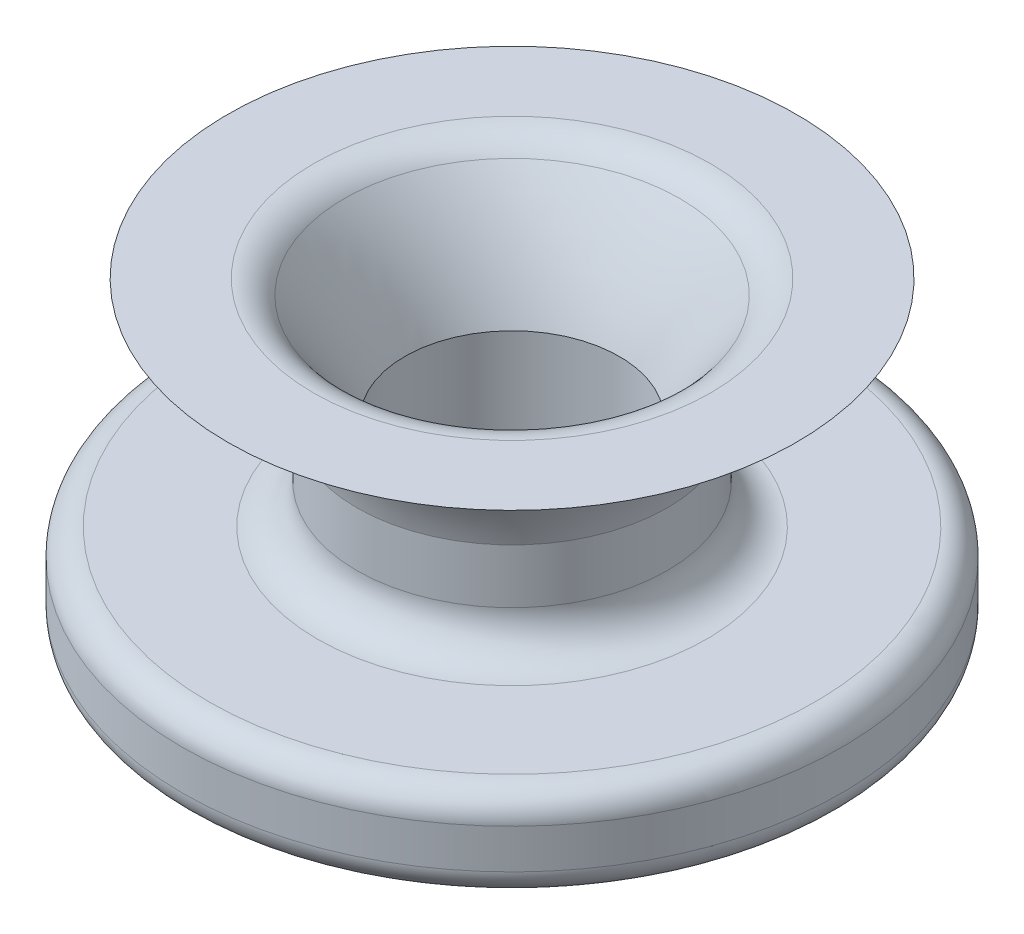
ISO-10303-21;
HEADER;
FILE_DESCRIPTION(('STEP AP214'),'2;1');
FILE_NAME('part.step','',(''),(''),'','','');
FILE_SCHEMA(('AUTOMOTIVE_DESIGN { 1 0 10303 214 1 1 1 1 }'));
ENDSEC;
DATA;
#1=APPLICATION_CONTEXT('core data for automotive mechanical design processes');
#2=APPLICATION_PROTOCOL_DEFINITION('international standard','automotive_design',2000,#1);
#3=PRODUCT_CONTEXT('',#1,'mechanical');
#4=PRODUCT('Part','Part','',(#3));
#5=PRODUCT_RELATED_PRODUCT_CATEGORY('part','',(#4));
#6=PRODUCT_DEFINITION_FORMATION('','',#4);
#7=PRODUCT_DEFINITION_CONTEXT('part definition',#1,'design');
#8=PRODUCT_DEFINITION('design','',#6,#7);
#9=PRODUCT_DEFINITION_SHAPE('','',#8);
#10=(LENGTH_UNIT() NAMED_UNIT(*) SI_UNIT(.MILLI.,.METRE.));
#11=(NAMED_UNIT(*) PLANE_ANGLE_UNIT() SI_UNIT($,.RADIAN.));
#12=(NAMED_UNIT(*) SI_UNIT($,.STERADIAN.) SOLID_ANGLE_UNIT());
#13=UNCERTAINTY_MEASURE_WITH_UNIT(LENGTH_MEASURE(1.E-05),#10,'distance_accuracy_value','');
#14=(GEOMETRIC_REPRESENTATION_CONTEXT(3) GLOBAL_UNCERTAINTY_ASSIGNED_CONTEXT((#13)) GLOBAL_UNIT_ASSIGNED_CONTEXT((#10,
#11,#12)) REPRESENTATION_CONTEXT('',''));
#15=CARTESIAN_POINT('',(0.,0.,0.));
#16=DIRECTION('',(0.,0.,1.));
#17=DIRECTION('',(1.,0.,0.));
#18=AXIS2_PLACEMENT_3D('',#15,#16,#17);
#19=CARTESIAN_POINT('',(0.,17.78,0.));
#20=DIRECTION('',(0.,-1.,0.));
#21=DIRECTION('',(0.,0.,-1.));
#22=AXIS2_PLACEMENT_3D('',#19,#20,#21);
#23=CYLINDRICAL_SURFACE('',#22,63.5);
#24=CARTESIAN_POINT('',(0.,12.7,0.));
#25=DIRECTION('',(0.,1.,0.));
#26=DIRECTION('',(0.,0.,1.));
#27=AXIS2_PLACEMENT_3D('',#24,#25,#26);
#28=CIRCLE('',#27,63.5);
#29=CARTESIAN_POINT('',(0.,12.7,63.5));
#30=VERTEX_POINT('',#29);
#31=EDGE_CURVE('E76',#30,#30,#28,.F.);
#32=ORIENTED_EDGE('',*,*,#31,.T.);
#33=EDGE_LOOP('',(#32));
#34=FACE_BOUND('',#33,.T.);
#35=CARTESIAN_POINT('',(0.,5.08,0.));
#36=DIRECTION('',(0.,1.,0.));
#37=DIRECTION('',(0.,0.,1.));
#38=AXIS2_PLACEMENT_3D('',#35,#36,#37);
#39=CIRCLE('',#38,63.5);
#40=CARTESIAN_POINT('',(0.,5.08,63.5));
#41=VERTEX_POINT('',#40);
#42=EDGE_CURVE('E104',#41,#41,#39,.T.);
#43=ORIENTED_EDGE('',*,*,#42,.T.);
#44=EDGE_LOOP('',(#43));
#45=FACE_BOUND('',#44,.T.);
#46=ADVANCED_FACE('F52',(#34,#45),#23,.T.);
#47=CARTESIAN_POINT('',(0.,17.78,0.));
#48=DIRECTION('',(0.,1.,0.));
#49=DIRECTION('',(0.,0.,1.));
#50=AXIS2_PLACEMENT_3D('',#47,#48,#49);
#51=PLANE('',#50);
#52=CARTESIAN_POINT('',(0.,17.78,0.));
#53=DIRECTION('',(0.,1.,0.));
#54=DIRECTION('',(0.,0.,1.));
#55=AXIS2_PLACEMENT_3D('',#52,#53,#54);
#56=CIRCLE('',#55,37.5120185921209);
#57=CARTESIAN_POINT('',(0.,17.78,37.5120185921209));
#58=VERTEX_POINT('',#57);
#59=EDGE_CURVE('E65',#58,#58,#56,.F.);
#60=ORIENTED_EDGE('',*,*,#59,.T.);
#61=EDGE_LOOP('',(#60));
#62=FACE_BOUND('',#61,.T.);
#63=CARTESIAN_POINT('',(0.,17.78,0.));
#64=DIRECTION('',(0.,1.,0.));
#65=DIRECTION('',(0.,0.,1.));
#66=AXIS2_PLACEMENT_3D('',#63,#64,#65);
#67=CIRCLE('',#66,58.42);
#68=CARTESIAN_POINT('',(0.,17.78,58.42));
#69=VERTEX_POINT('',#68);
#70=EDGE_CURVE('E80',#69,#69,#67,.T.);
#71=ORIENTED_EDGE('',*,*,#70,.T.);
#72=EDGE_LOOP('',(#71));
#73=FACE_BOUND('',#72,.T.);
#74=ADVANCED_FACE('F163',(#62,#73),#51,.T.);
#75=CARTESIAN_POINT('',(0.,0.,0.));
#76=DIRECTION('',(0.,1.,0.));
#77=DIRECTION('',(0.,0.,1.));
#78=AXIS2_PLACEMENT_3D('',#75,#76,#77);
#79=PLANE('',#78);
#80=CARTESIAN_POINT('',(0.,0.,0.));
#81=DIRECTION('',(0.,1.,0.));
#82=DIRECTION('',(0.,0.,1.));
#83=AXIS2_PLACEMENT_3D('',#80,#81,#82);
#84=CIRCLE('',#83,58.42);
#85=CARTESIAN_POINT('',(0.,0.,58.42));
#86=VERTEX_POINT('',#85);
#87=EDGE_CURVE('E96',#86,#86,#84,.F.);
#88=ORIENTED_EDGE('',*,*,#87,.T.);
#89=EDGE_LOOP('',(#88));
#90=FACE_BOUND('',#89,.T.);
#91=CARTESIAN_POINT('',(0.,0.,0.));
#92=DIRECTION('',(0.,1.,0.));
#93=DIRECTION('',(0.,0.,1.));
#94=AXIS2_PLACEMENT_3D('',#91,#92,#93);
#95=CIRCLE('',#94,30.4465710395546);
#96=CARTESIAN_POINT('',(0.,0.,30.4465710395546));
#97=VERTEX_POINT('',#96);
#98=EDGE_CURVE('E100',#97,#97,#95,.T.);
#99=ORIENTED_EDGE('',*,*,#98,.T.);
#100=EDGE_LOOP('',(#99));
#101=FACE_BOUND('',#100,.T.);
#102=ADVANCED_FACE('F161',(#90,#101),#79,.F.);
#103=CARTESIAN_POINT('',(0.,-20.32,0.));
#104=DIRECTION('',(0.,1.,0.));
#105=DIRECTION('',(0.,0.,1.));
#106=AXIS2_PLACEMENT_3D('',#103,#104,#105);
#107=CYLINDRICAL_SURFACE('',#106,25.3665710395546);
#108=CARTESIAN_POINT('',(0.,-5.08,0.));
#109=DIRECTION('',(0.,1.,0.));
#110=DIRECTION('',(0.,0.,1.));
#111=AXIS2_PLACEMENT_3D('',#108,#109,#110);
#112=CIRCLE('',#111,25.3665710395546);
#113=CARTESIAN_POINT('',(0.,-5.08,25.3665710395546));
#114=VERTEX_POINT('',#113);
#115=EDGE_CURVE('E92',#114,#114,#112,.F.);
#116=ORIENTED_EDGE('',*,*,#115,.T.);
#117=EDGE_LOOP('',(#116));
#118=FACE_BOUND('',#117,.T.);
#119=CARTESIAN_POINT('',(0.,-14.0589377589314,25.3665710395546));
#120=CARTESIAN_POINT('',(-0.212725574957583,-14.0589289889175,25.3665676270994));
#121=CARTESIAN_POINT('',(-0.425574499846383,-14.0410617989644,25.3638671042424));
#122=CARTESIAN_POINT('',(-0.84532267746515,-13.9700833462718,25.3533540914481));
#123=CARTESIAN_POINT('',(-1.05221593615985,-13.9169377886341,25.3455366273198));
#124=CARTESIAN_POINT('',(-1.45391746551735,-13.7770266266348,25.3256682192015));
#125=CARTESIAN_POINT('',(-1.64873474963173,-13.690286456371,25.3136204785486));
#126=CARTESIAN_POINT('',(-2.02101919870925,-13.4857105006767,25.2866227141975));
#127=CARTESIAN_POINT('',(-2.19848876385938,-13.3678790253306,25.2716730928532));
#128=CARTESIAN_POINT('',(-2.53245968787075,-13.1034819839262,25.2404030273083));
#129=CARTESIAN_POINT('',(-2.68880550104564,-12.9567209695592,25.2240737163019));
#130=CARTESIAN_POINT('',(-2.97474880628645,-12.6390514292007,25.1919540712024));
#131=CARTESIAN_POINT('',(-3.10434475815415,-12.4681415137224,25.1761637681879));
#132=CARTESIAN_POINT('',(-3.33371526341743,-12.1059803443042,25.1468239133494));
#133=CARTESIAN_POINT('',(-3.43333928774484,-11.914632745732,25.1332858199334));
#134=CARTESIAN_POINT('',(-3.59897599603816,-11.5176833917692,25.1101042630116));
#135=CARTESIAN_POINT('',(-3.66499051678523,-11.3120824160328,25.1004605866793));
#136=CARTESIAN_POINT('',(-3.76105117321898,-10.8940985295974,25.0862469144643));
#137=CARTESIAN_POINT('',(-3.79136362297402,-10.6817781230826,25.0816393711629));
#138=CARTESIAN_POINT('',(-3.81598470123001,-10.2550182017739,25.0779056507718));
#139=CARTESIAN_POINT('',(-3.81029540234333,-10.0405788096792,25.0787791581392));
#140=CARTESIAN_POINT('',(-3.76329211122909,-9.61754957649355,25.0858745110686));
#141=CARTESIAN_POINT('',(-3.72227475813492,-9.40892592086827,25.0920518208331));
#142=CARTESIAN_POINT('',(-3.60624406271129,-9.00155603258722,25.1089891761807));
#143=CARTESIAN_POINT('',(-3.53122975634796,-8.80281008020566,25.1197493517172));
#144=CARTESIAN_POINT('',(-3.34902609739461,-8.41993489041128,25.1446892147121));
#145=CARTESIAN_POINT('',(-3.24171112424128,-8.23586633598504,25.1588822096339));
#146=CARTESIAN_POINT('',(-2.99804187160865,-7.88823706257353,25.1890788989909));
#147=CARTESIAN_POINT('',(-2.86168568126504,-7.72467769418461,25.2050827125426));
#148=CARTESIAN_POINT('',(-2.56217648810561,-7.42099046371648,25.2372945666815));
#149=CARTESIAN_POINT('',(-2.39876845161162,-7.28111405077884,25.2535030457687));
#150=CARTESIAN_POINT('',(-2.05066326938029,-7.03073225924491,25.2841488842157));
#151=CARTESIAN_POINT('',(-1.8659660299775,-6.92022700987909,25.2985862357825));
#152=CARTESIAN_POINT('',(-1.48030715155694,-6.7317113328485,25.3240782631661));
#153=CARTESIAN_POINT('',(-1.27933587126795,-6.65372033838984,25.3351309149622));
#154=CARTESIAN_POINT('',(-0.866945434234308,-6.53266582650016,25.352591284686));
#155=CARTESIAN_POINT('',(-0.655526986726603,-6.48959994152109,25.358999317466));
#156=CARTESIAN_POINT('',(-0.230413765214077,-6.43995256593997,25.3664067282033));
#157=CARTESIAN_POINT('',(-0.0167602226955133,-6.43302538862371,25.3674573505551));
#158=CARTESIAN_POINT('',(0.408657508707453,-6.45493445839469,25.3641710654188));
#159=CARTESIAN_POINT('',(0.620421756034826,-6.48376959532928,25.3598343251681));
#160=CARTESIAN_POINT('',(1.03500236250965,-6.57609731800804,25.3462922960482));
#161=CARTESIAN_POINT('',(1.23785707451067,-6.6394214569481,25.3371106766594));
#162=CARTESIAN_POINT('',(1.63007015862704,-6.7987519860428,25.3149050642436));
#163=CARTESIAN_POINT('',(1.81942789497277,-6.89475991452545,25.3018808903629));
#164=CARTESIAN_POINT('',(2.18079170080593,-7.11754349514817,25.2733101698299));
#165=CARTESIAN_POINT('',(2.35266117996513,-7.24453839055214,25.2577459233612));
#166=CARTESIAN_POINT('',(2.67277147596659,-7.52538578138643,25.2258824314327));
#167=CARTESIAN_POINT('',(2.82101091478097,-7.6792398420614,25.2095831431787));
#168=CARTESIAN_POINT('',(3.09091124959624,-8.01097726512099,25.1779240749576));
#169=CARTESIAN_POINT('',(3.21234039793021,-8.18905016181314,25.1625732546789));
#170=CARTESIAN_POINT('',(3.42356227952585,-8.56326856759309,25.1347079931214));
#171=CARTESIAN_POINT('',(3.51335586932431,-8.75941358719442,25.1221934750528));
#172=CARTESIAN_POINT('',(3.65839869536605,-9.16351784001947,25.1014826297831));
#173=CARTESIAN_POINT('',(3.71376981193218,-9.37143251302482,25.0932710833834));
#174=CARTESIAN_POINT('',(3.78878375569364,-9.79374275126588,25.082055475485));
#175=CARTESIAN_POINT('',(3.808429057303,-10.0081378666124,25.0790510533351));
#176=CARTESIAN_POINT('',(3.81137473425493,-10.4350131345762,25.0786033525456));
#177=CARTESIAN_POINT('',(3.79503950308554,-10.6474908039106,25.0811043178415));
#178=CARTESIAN_POINT('',(3.72726876839914,-11.0666405541305,25.0912644081167));
#179=CARTESIAN_POINT('',(3.67583332173517,-11.2733126444188,25.0989235247412));
#180=CARTESIAN_POINT('',(3.53945119301433,-11.674883136285,25.1185174161217));
#181=CARTESIAN_POINT('',(3.45453004689416,-11.8697903793503,25.1304489321432));
#182=CARTESIAN_POINT('',(3.25362340634711,-12.2426497385904,25.1572472024579));
#183=CARTESIAN_POINT('',(3.13763685447357,-12.4206012773242,25.1721140566636));
#184=CARTESIAN_POINT('',(2.87656825288623,-12.7563490529292,25.2032871110597));
#185=CARTESIAN_POINT('',(2.73121634776089,-12.9139343210125,25.2196058115575));
#186=CARTESIAN_POINT('',(2.41611329134012,-13.2026063040384,25.2517395517417));
#187=CARTESIAN_POINT('',(2.24635647708284,-13.3336868517392,25.267554473487));
#188=CARTESIAN_POINT('',(1.88616004677103,-13.5662749442242,25.2969984572387));
#189=CARTESIAN_POINT('',(1.69561144818651,-13.6676152750084,25.3106149731665));
#190=CARTESIAN_POINT('',(1.30008284483206,-13.8367012689529,25.3340048917714));
#191=CARTESIAN_POINT('',(1.09511803240672,-13.90448171049,25.3437822707917));
#192=CARTESIAN_POINT('',(0.741029616655482,-13.9891550138838,25.356161605614));
#193=CARTESIAN_POINT('',(0.594091102171736,-14.0152835268601,25.3600450855099));
#194=CARTESIAN_POINT('',(0.298121904508435,-14.0501778643661,25.3652509823352));
#195=CARTESIAN_POINT('',(0.149091247452599,-14.0589439054999,25.3665734312144));
#196=CARTESIAN_POINT('',(0.,-14.0589377589314,25.3665710395546));
#197=B_SPLINE_CURVE_WITH_KNOTS('',3,(#119,#120,#121,#122,#123,#124,#125,#126,#127,#128,#129,
#130,#131,#132,#133,#134,#135,#136,#137,#138,#139,#140,#141,#142,#143,#144,#145,#146,#147,#148,
#149,#150,#151,#152,#153,#154,#155,#156,#157,#158,#159,#160,#161,#162,#163,#164,#165,#166,#167,
#168,#169,#170,#171,#172,#173,#174,#175,#176,#177,#178,#179,#180,#181,#182,#183,#184,#185,#186,
#187,#188,#189,#190,#191,#192,#193,#194,#195,#196),.UNSPECIFIED.,.T.,.F.,(4,2,2,2,2,2,2,2,2,2,2,
2,2,2,2,2,2,2,2,2,2,2,2,2,2,2,2,2,2,2,2,2,2,2,2,2,2,2,4),(0.,0.637631926955998,1.27588461985455,
1.91365504053457,2.55133709562519,3.19348488909086,3.83566964570774,4.48102780163782,
5.12635068453955,5.76682876596024,6.40726997554061,7.04238544213786,7.67751891950017,
8.31515513191086,8.95283331270443,9.59690685453292,10.24098323018,10.885444009122,
11.5298610968786,12.1681025247761,12.8063241405421,13.4414562289561,14.0766182152681,
14.7164115881896,15.3562422581617,16.0014040883906,16.646548449438,17.2893953272137,
17.9321976789255,18.5685199978716,19.2048412861468,19.8406782562659,20.4765368726226,
21.1185287975874,21.7606699327538,22.4063552097743,23.0513699502122,23.4982674397446,
23.9451593540076),.UNSPECIFIED.);
#198=CARTESIAN_POINT('',(0.,-14.0589377589314,25.3665710395546));
#199=VERTEX_POINT('',#198);
#200=EDGE_CURVE('E149',#199,#199,#197,.T.);
#201=ORIENTED_EDGE('',*,*,#200,.T.);
#202=EDGE_LOOP('',(#201));
#203=FACE_BOUND('',#202,.T.);
#204=CARTESIAN_POINT('',(-3.81,-10.2489377589314,-25.0788122985274));
#205=CARTESIAN_POINT('',(-3.80999121693559,-10.4616480770084,-25.0788158577498));
#206=CARTESIAN_POINT('',(-3.79212650329176,-10.6744817859889,-25.0815477907949));
#207=CARTESIAN_POINT('',(-3.72115877925998,-11.0941983559161,-25.0921729142172));
#208=CARTESIAN_POINT('',(-3.6680214188822,-11.3010752107188,-25.1000711356343));
#209=CARTESIAN_POINT('',(-3.52813422999532,-11.7027420312132,-25.1201145384984));
#210=CARTESIAN_POINT('',(-3.44141022320319,-11.8975411492315,-25.1322564566554));
#211=CARTESIAN_POINT('',(-3.23687234775703,-12.269795078364,-25.1594152906736));
#212=CARTESIAN_POINT('',(-3.11906275042728,-12.4472522677636,-25.1744318114716));
#213=CARTESIAN_POINT('',(-2.85468795023759,-12.7812368300799,-25.2057826379289));
#214=CARTESIAN_POINT('',(-2.70792239902923,-12.9376048163337,-25.2221256293731));
#215=CARTESIAN_POINT('',(-2.39023443046103,-13.2235910122872,-25.2542104320492));
#216=CARTESIAN_POINT('',(-2.21931068457933,-13.3532077499012,-25.2699522101584));
#217=CARTESIAN_POINT('',(-1.85713706395864,-13.5826002595825,-25.2991517886458));
#218=CARTESIAN_POINT('',(-1.6657932241922,-13.682229246717,-25.3125982192192));
#219=CARTESIAN_POINT('',(-1.26885202801869,-13.8478761624643,-25.3355958500412));
#220=CARTESIAN_POINT('',(-1.06325542733577,-13.9138958715954,-25.3451472566311));
#221=CARTESIAN_POINT('',(-0.645286299190239,-14.0099669741701,-25.3592173798415));
#222=CARTESIAN_POINT('',(-0.432976396422413,-14.0402852688465,-25.3637734235334));
#223=CARTESIAN_POINT('',(-0.00623714220890836,-14.0649216778441,-25.3674674117583));
#224=CARTESIAN_POINT('',(0.208192090454093,-14.0592417984687,-25.366605658244));
#225=CARTESIAN_POINT('',(0.631262137544693,-14.0122536911424,-25.3595909702672));
#226=CARTESIAN_POINT('',(0.839935651217738,-13.9712326093332,-25.3534806811795));
#227=CARTESIAN_POINT('',(1.24740331954972,-13.8551772791466,-25.3367029962049));
#228=CARTESIAN_POINT('',(1.44619721924236,-13.7801421534634,-25.3260354827764));
#229=CARTESIAN_POINT('',(1.82913157666831,-13.5978948407233,-25.3012686853478));
#230=CARTESIAN_POINT('',(2.01321365214045,-13.4905617995437,-25.2871565501944));
#231=CARTESIAN_POINT('',(2.3608623600638,-13.2468536885649,-25.2570732320497));
#232=CARTESIAN_POINT('',(2.52442763743652,-13.1104767020956,-25.2411019263994));
#233=CARTESIAN_POINT('',(2.82809239493848,-12.8109524122879,-25.2088954743524));
#234=CARTESIAN_POINT('',(2.9679445931165,-12.6475544054292,-25.1926592792242));
#235=CARTESIAN_POINT('',(3.2182822577545,-12.2994780381406,-25.1619065773503));
#236=CARTESIAN_POINT('',(3.32876754246613,-12.1147995460185,-25.1473900812479));
#237=CARTESIAN_POINT('',(3.51726870928749,-11.7291464524343,-25.1217206422976));
#238=CARTESIAN_POINT('',(3.59525912140076,-11.5281592147797,-25.1105703398039));
#239=CARTESIAN_POINT('',(3.71630761164768,-11.1157339892266,-25.0929424577281));
#240=CARTESIAN_POINT('',(3.75936815851569,-10.9042967410232,-25.0864645479195));
#241=CARTESIAN_POINT('',(3.80899533773089,-10.4791736702668,-25.078977532049));
#242=CARTESIAN_POINT('',(3.81591253220762,-10.2655296639841,-25.077915894787));
#243=CARTESIAN_POINT('',(3.79398690026279,-9.84013337596007,-25.0812421519234));
#244=CARTESIAN_POINT('',(3.76514518646851,-9.62838103556652,-25.0856298767666));
#245=CARTESIAN_POINT('',(3.67281778808862,-9.21386533327326,-25.0993122110634));
#246=CARTESIAN_POINT('',(3.60950680026438,-9.01106217170732,-25.1085820692763));
#247=CARTESIAN_POINT('',(3.4502197638251,-8.61894639651238,-25.1309637697604));
#248=CARTESIAN_POINT('',(3.35424209810965,-8.42963445130102,-25.1440758022264));
#249=CARTESIAN_POINT('',(3.1315040558724,-8.06830364466675,-25.1727881903353));
#250=CARTESIAN_POINT('',(3.0045167764685,-7.89642611281215,-25.1884065826185));
#251=CARTESIAN_POINT('',(2.72367959529239,-7.57629604151126,-25.2203175786335));
#252=CARTESIAN_POINT('',(2.56982817042236,-7.4280448425028,-25.2366102205527));
#253=CARTESIAN_POINT('',(2.23808600994387,-7.1581165145211,-25.2681981394094));
#254=CARTESIAN_POINT('',(2.0600051918126,-7.03667172532775,-25.283483947585));
#255=CARTESIAN_POINT('',(1.6857665246192,-6.8254224332219,-25.3111886917817));
#256=CARTESIAN_POINT('',(1.48960917134302,-6.73561706285929,-25.3236077063977));
#257=CARTESIAN_POINT('',(1.08551062365731,-6.59056697411588,-25.3441380899648));
#258=CARTESIAN_POINT('',(0.877615843426841,-6.53519528153732,-25.3522652681343));
#259=CARTESIAN_POINT('',(0.455347768360412,-6.4601734545531,-25.3633626313144));
#260=CARTESIAN_POINT('',(0.240974903536428,-6.44052095439758,-25.3663331578591));
#261=CARTESIAN_POINT('',(-0.185910749063079,-6.43755323331542,-25.3667790809456));
#262=CARTESIAN_POINT('',(-0.398421094910121,-6.45388253474658,-25.3643082349768));
#263=CARTESIAN_POINT('',(-0.817637735436576,-6.5216528604452,-25.3542574598654));
#264=CARTESIAN_POINT('',(-1.02434404883065,-6.57309377148442,-25.3466775471985));
#265=CARTESIAN_POINT('',(-1.42598693980524,-6.70950087422137,-25.3272564152824));
#266=CARTESIAN_POINT('',(-1.62093205929443,-6.79444238878178,-25.3154183332395));
#267=CARTESIAN_POINT('',(-1.99385874679123,-6.99540156769219,-25.2887810247924));
#268=CARTESIAN_POINT('',(-2.17183976088925,-7.11142024629842,-25.273981701747));
#269=CARTESIAN_POINT('',(-2.50758883469504,-7.37252544404698,-25.2428932667122));
#270=CARTESIAN_POINT('',(-2.66515165225072,-7.51787439467229,-25.2265914833796));
#271=CARTESIAN_POINT('',(-2.95377971213801,-7.83296213726103,-25.1944290891013));
#272=CARTESIAN_POINT('',(-3.08483872688536,-8.0027066454444,-25.1785685825955));
#273=CARTESIAN_POINT('',(-3.3174021383531,-8.36289183694123,-25.1489886604016));
#274=CARTESIAN_POINT('',(-3.41873583047533,-8.55344375494821,-25.1352818135903));
#275=CARTESIAN_POINT('',(-3.58780850941623,-8.948979115464,-25.1117085588574));
#276=CARTESIAN_POINT('',(-3.6555823449108,-9.15394733429859,-25.1018381694455));
#277=CARTESIAN_POINT('',(-3.74023813238881,-9.50801832917545,-25.0893347098409));
#278=CARTESIAN_POINT('',(-3.7663587809108,-9.6549348037337,-25.0854097394035));
#279=CARTESIAN_POINT('',(-3.80124267939018,-9.95085992290601,-25.0801473034176));
#280=CARTESIAN_POINT('',(-3.81000615524701,-10.0998685402659,-25.0788098041938));
#281=CARTESIAN_POINT('',(-3.81,-10.2489377589314,-25.0788122985274));
#282=B_SPLINE_CURVE_WITH_KNOTS('',3,(#204,#205,#206,#207,#208,#209,#210,#211,#212,#213,#214,
#215,#216,#217,#218,#219,#220,#221,#222,#223,#224,#225,#226,#227,#228,#229,#230,#231,#232,#233,
#234,#235,#236,#237,#238,#239,#240,#241,#242,#243,#244,#245,#246,#247,#248,#249,#250,#251,#252,
#253,#254,#255,#256,#257,#258,#259,#260,#261,#262,#263,#264,#265,#266,#267,#268,#269,#270,#271,
#272,#273,#274,#275,#276,#277,#278,#279,#280,#281),.UNSPECIFIED.,.T.,.F.,(4,2,2,2,2,2,2,2,2,2,2,
2,2,2,2,2,2,2,2,2,2,2,2,2,2,2,2,2,2,2,2,2,2,2,2,2,2,2,4),(0.,0.637586085616618,1.2757939921375,
1.91351220958148,2.55114284676449,3.19335064631024,3.83559377628152,4.48093128222679,
5.12623459657489,5.76668240820177,6.40709452575863,7.0423518660498,7.67762559212204,
8.31530662118115,8.95302974517952,9.59704099693054,10.2410562342981,10.8855753156933,
11.5300488405122,12.1682597170919,12.8064507364375,13.4414369918005,14.0764546854973,
14.7162659917264,15.3561135846791,16.0013063245434,16.6464813739411,17.2892630091341,
17.9320020701285,18.5684197668424,19.2048354112401,19.8407831335706,20.4767516136686,
21.1186850754195,21.7607691971218,22.4064715203549,23.0515019304974,23.4983335533323,
23.9451593607222),.UNSPECIFIED.);
#283=CARTESIAN_POINT('',(-3.81,-10.2489377589314,-25.0788122985274));
#284=VERTEX_POINT('',#283);
#285=EDGE_CURVE('E118',#284,#284,#282,.T.);
#286=ORIENTED_EDGE('',*,*,#285,.T.);
#287=EDGE_LOOP('',(#286));
#288=FACE_BOUND('',#287,.T.);
#289=CARTESIAN_POINT('',(0.,-20.32,0.));
#290=DIRECTION('',(0.,-1.,0.));
#291=DIRECTION('',(0.,0.,-1.));
#292=AXIS2_PLACEMENT_3D('',#289,#290,#291);
#293=CIRCLE('',#292,25.3665710395546);
#294=CARTESIAN_POINT('',(0.,-20.32,-25.3665710395546));
#295=VERTEX_POINT('',#294);
#296=EDGE_CURVE('E108',#295,#295,#293,.T.);
#297=ORIENTED_EDGE('',*,*,#296,.F.);
#298=EDGE_LOOP('',(#297));
#299=FACE_BOUND('',#298,.T.);
#300=ADVANCED_FACE('F156',(#118,#203,#288,#299),#107,.T.);
#301=CARTESIAN_POINT('',(0.,-20.32,0.));
#302=DIRECTION('',(0.,-1.,0.));
#303=DIRECTION('',(0.,0.,-1.));
#304=AXIS2_PLACEMENT_3D('',#301,#302,#303);
#305=PLANE('',#304);
#306=CARTESIAN_POINT('',(0.,-20.32,0.));
#307=DIRECTION('',(0.,-1.,0.));
#308=DIRECTION('',(0.,0.,-1.));
#309=AXIS2_PLACEMENT_3D('',#306,#307,#308);
#310=CIRCLE('',#309,21.59);
#311=CARTESIAN_POINT('',(0.,-20.32,-21.59));
#312=VERTEX_POINT('',#311);
#313=EDGE_CURVE('E84',#312,#312,#310,.F.);
#314=ORIENTED_EDGE('',*,*,#313,.T.);
#315=EDGE_LOOP('',(#314));
#316=FACE_BOUND('',#315,.T.);
#317=ORIENTED_EDGE('',*,*,#296,.T.);
#318=EDGE_LOOP('',(#317));
#319=FACE_BOUND('',#318,.T.);
#320=ADVANCED_FACE('F160',(#316,#319),#305,.T.);
#321=CARTESIAN_POINT('',(0.,0.,0.));
#322=DIRECTION('',(0.,-1.,0.));
#323=DIRECTION('',(0.,0.,-1.));
#324=AXIS2_PLACEMENT_3D('',#321,#322,#323);
#325=CYLINDRICAL_SURFACE('',#324,19.05);
#326=CARTESIAN_POINT('',(0.,-17.78,0.));
#327=DIRECTION('',(0.,-1.,0.));
#328=DIRECTION('',(0.,0.,-1.));
#329=AXIS2_PLACEMENT_3D('',#326,#327,#328);
#330=CIRCLE('',#329,19.05);
#331=CARTESIAN_POINT('',(0.,-17.78,-19.05));
#332=VERTEX_POINT('',#331);
#333=EDGE_CURVE('E88',#332,#332,#330,.T.);
#334=ORIENTED_EDGE('',*,*,#333,.T.);
#335=EDGE_LOOP('',(#334));
#336=FACE_BOUND('',#335,.T.);
#337=CARTESIAN_POINT('',(0.,-6.43893775893144,-19.05));
#338=CARTESIAN_POINT('',(0.211748014879932,-6.43894554847014,-19.0499960978312));
#339=CARTESIAN_POINT('',(0.4235945053678,-6.45664985063817,-19.0464332752906));
#340=CARTESIAN_POINT('',(0.841299464295164,-6.52694304437053,-19.0325641302451));
#341=CARTESIAN_POINT('',(1.04715303983257,-6.5795596499052,-19.0222524504732));
#342=CARTESIAN_POINT('',(1.44677246305322,-6.71798701142665,-18.9960370375026));
#343=CARTESIAN_POINT('',(1.64054968282524,-6.80376597330969,-18.9801386618226));
#344=CARTESIAN_POINT('',(2.0109484375727,-7.00598862194948,-18.9444781651459));
#345=CARTESIAN_POINT('',(2.18757099343885,-7.12243048239493,-18.9247162742819));
#346=CARTESIAN_POINT('',(2.52105214856963,-7.38434542218177,-18.8832044990704));
#347=CARTESIAN_POINT('',(2.67764495391396,-7.5301535929718,-18.8614334037101));
#348=CARTESIAN_POINT('',(2.9643200426766,-7.84594186538395,-18.8185112752492));
#349=CARTESIAN_POINT('',(3.09440025557537,-8.0159238531187,-18.7973602906869));
#350=CARTESIAN_POINT('',(3.32548898025438,-8.37714645430623,-18.7578660330398));
#351=CARTESIAN_POINT('',(3.42622227707874,-8.56856638179385,-18.7395500505261));
#352=CARTESIAN_POINT('',(3.59399458967118,-8.96604148933871,-18.708100813104));
#353=CARTESIAN_POINT('',(3.66103693408665,-9.17209522128744,-18.694967046223));
#354=CARTESIAN_POINT('',(3.75866139256178,-9.59012918542005,-18.6755838798203));
#355=CARTESIAN_POINT('',(3.78970983722185,-9.80199635210161,-18.6692465100135));
#356=CARTESIAN_POINT('',(3.81591360663526,-10.2280201783148,-18.6639088887418));
#357=CARTESIAN_POINT('',(3.81107260153867,-10.4421766015045,-18.6649078870404));
#358=CARTESIAN_POINT('',(3.76601192351833,-10.8632880212921,-18.6740501990257));
#359=CARTESIAN_POINT('',(3.72632683832939,-11.0703029143717,-18.6820855539939));
#360=CARTESIAN_POINT('',(3.61354834041371,-11.4746760110173,-18.704225208621));
#361=CARTESIAN_POINT('',(3.54045333221356,-11.6720337529128,-18.7183297981112));
#362=CARTESIAN_POINT('',(3.36241942580071,-12.0530309060222,-18.7511290648858));
#363=CARTESIAN_POINT('',(3.25726863619436,-12.23656858009,-18.7698541219076));
#364=CARTESIAN_POINT('',(3.0182575191219,-12.5835946973278,-18.8097649752482));
#365=CARTESIAN_POINT('',(2.88439389219951,-12.7470808329343,-18.8309510542403));
#366=CARTESIAN_POINT('',(2.58889475067583,-13.0524477822924,-18.8738645093012));
#367=CARTESIAN_POINT('',(2.42680297421941,-13.1938870424747,-18.8955947669359));
#368=CARTESIAN_POINT('',(2.08096494167626,-13.4476379133391,-18.9367991360186));
#369=CARTESIAN_POINT('',(1.89721840791547,-13.55994915046,-18.9562732185298));
#370=CARTESIAN_POINT('',(1.51279626400869,-13.7523375690824,-18.9908188951299));
#371=CARTESIAN_POINT('',(1.31209473261999,-13.8323642737171,-19.0058835851192));
#372=CARTESIAN_POINT('',(0.899727600269412,-13.9574411650184,-19.0298606824374));
#373=CARTESIAN_POINT('',(0.688063330776032,-14.002495588632,-19.0387738350202));
#374=CARTESIAN_POINT('',(0.263573535439442,-14.0557238478876,-19.0493397981277));
#375=CARTESIAN_POINT('',(0.0508266509204439,-14.0645019573799,-19.0511115542591));
#376=CARTESIAN_POINT('',(-0.373093999274242,-14.0465557963617,-19.0475254785369));
#377=CARTESIAN_POINT('',(-0.584267852710853,-14.0198335215981,-19.0421680474691));
#378=CARTESIAN_POINT('',(-0.997098564396322,-13.932147155729,-19.0249999995055));
#379=CARTESIAN_POINT('',(-1.19882392317503,-13.8714931179544,-19.0132478410003));
#380=CARTESIAN_POINT('',(-1.58924102077373,-13.7180037850128,-18.9846033335253));
#381=CARTESIAN_POINT('',(-1.77793178183903,-13.6251660788127,-18.967710599462));
#382=CARTESIAN_POINT('',(-2.13947187174449,-13.4086374695499,-18.9303626294185));
#383=CARTESIAN_POINT('',(-2.31209898292584,-13.2845827631731,-18.9098663116517));
#384=CARTESIAN_POINT('',(-2.63430265284418,-13.0096287404317,-18.8676813970185));
#385=CARTESIAN_POINT('',(-2.78387673702621,-12.8587265459479,-18.8459926724956));
#386=CARTESIAN_POINT('',(-3.05806065084961,-12.5316102882263,-18.8034664655204));
#387=CARTESIAN_POINT('',(-3.18225564632938,-12.3550457734481,-18.7826469748889));
#388=CARTESIAN_POINT('',(-3.39922645039509,-11.9832064721625,-18.744597707435));
#389=CARTESIAN_POINT('',(-3.49200351606626,-11.7879324346562,-18.7273677869984));
#390=CARTESIAN_POINT('',(-3.64293851642727,-11.3852007411017,-18.698593816265));
#391=CARTESIAN_POINT('',(-3.7012759342039,-11.1778125539201,-18.6870203426303));
#392=CARTESIAN_POINT('',(-3.78221996269962,-10.7559213011311,-18.6708073417762));
#393=CARTESIAN_POINT('',(-3.80483123293768,-10.5414191670738,-18.6661669103313));
#394=CARTESIAN_POINT('',(-3.81350867040505,-10.1155539850176,-18.6643956009555));
#395=CARTESIAN_POINT('',(-3.80023035255011,-9.90420458151953,-18.6671300211124));
#396=CARTESIAN_POINT('',(-3.73895227862123,-9.48681717279329,-18.6794993497638));
#397=CARTESIAN_POINT('',(-3.69095280145263,-9.28077912491423,-18.6891342028291));
#398=CARTESIAN_POINT('',(-3.56188734598101,-8.88028017910496,-18.7141585667499));
#399=CARTESIAN_POINT('',(-3.48090175059308,-8.68579244541723,-18.7295340808174));
#400=CARTESIAN_POINT('',(-3.28823819593211,-8.31306258293322,-18.7643153405159));
#401=CARTESIAN_POINT('',(-3.1765576630323,-8.13482181803866,-18.7837214240579));
#402=CARTESIAN_POINT('',(-2.92343553533623,-7.79638142903874,-18.8247893959349));
#403=CARTESIAN_POINT('',(-2.78152055036603,-7.6365397632619,-18.8464840078596));
#404=CARTESIAN_POINT('',(-2.47293524594006,-7.3427223158653,-18.8894497193215));
#405=CARTESIAN_POINT('',(-2.3062592450542,-7.20875248682263,-18.9107207203873));
#406=CARTESIAN_POINT('',(-1.95078716682622,-6.96915776549548,-18.9507050139817));
#407=CARTESIAN_POINT('',(-1.76177784967767,-6.86384418643454,-18.9693892094533));
#408=CARTESIAN_POINT('',(-1.36842383518419,-6.68664063183843,-19.0018082657385));
#409=CARTESIAN_POINT('',(-1.16409315388851,-6.61472053081265,-19.0155475849813));
#410=CARTESIAN_POINT('',(-0.799419872799598,-6.52027383688107,-19.0338597958836));
#411=CARTESIAN_POINT('',(-0.641153139892518,-6.48982719090489,-19.039876950337));
#412=CARTESIAN_POINT('',(-0.321943191050355,-6.44915651284607,-19.0479484727299));
#413=CARTESIAN_POINT('',(-0.161000060582238,-6.43893183624923,-19.0500029669672));
#414=CARTESIAN_POINT('',(0.,-6.43893775893144,-19.05));
#415=B_SPLINE_CURVE_WITH_KNOTS('',3,(#337,#338,#339,#340,#341,#342,#343,#344,#345,#346,#347,
#348,#349,#350,#351,#352,#353,#354,#355,#356,#357,#358,#359,#360,#361,#362,#363,#364,#365,#366,
#367,#368,#369,#370,#371,#372,#373,#374,#375,#376,#377,#378,#379,#380,#381,#382,#383,#384,#385,
#386,#387,#388,#389,#390,#391,#392,#393,#394,#395,#396,#397,#398,#399,#400,#401,#402,#403,#404,
#405,#406,#407,#408,#409,#410,#411,#412,#413,#414),.UNSPECIFIED.,.T.,.F.,(4,2,2,2,2,2,2,2,2,2,2,
2,2,2,2,2,2,2,2,2,2,2,2,2,2,2,2,2,2,2,2,2,2,2,2,2,2,2,4),(0.,0.634655057819395,1.26981451913394,
1.9043665313038,2.53888075749959,3.18109347312743,3.82335632360746,4.47146152972565,
5.11950269081402,5.75905065246448,6.39853321315068,7.02837279897521,7.65824246560311,
8.29236937679288,8.92656919599845,9.57217741995647,10.2177939233032,10.8644159719743,
11.5109596691312,12.1466890293017,12.7823826518008,13.4123602955586,14.0423851441665,
14.680123015907,15.3179292960159,15.9654479489045,16.6129406904001,17.2570285173828,
17.9010323334248,18.5333534298654,19.1656694471044,19.7964537237795,20.4272909049051,
21.0688457047474,21.7105479377407,22.3589658233778,23.0067976052535,23.489365338581,
23.971917691271),.UNSPECIFIED.);
#416=CARTESIAN_POINT('',(0.,-6.43893775893144,-19.05));
#417=VERTEX_POINT('',#416);
#418=EDGE_CURVE('E109',#417,#417,#415,.T.);
#419=ORIENTED_EDGE('',*,*,#418,.T.);
#420=EDGE_LOOP('',(#419));
#421=FACE_BOUND('',#420,.T.);
#422=CARTESIAN_POINT('',(-3.81,-10.2489377589314,18.6651118400078));
#423=CARTESIAN_POINT('',(-3.80999217378478,-10.4606380295527,18.6651160489152));
#424=CARTESIAN_POINT('',(-3.79229558424613,-10.6724368738315,18.6687526650375));
#425=CARTESIAN_POINT('',(-3.72203580045062,-11.0900429035268,18.6828848327157));
#426=CARTESIAN_POINT('',(-3.66944470733858,-11.2958451569945,18.6933858724164));
#427=CARTESIAN_POINT('',(-3.53109193178123,-11.695355884711,18.7200110888027));
#428=CARTESIAN_POINT('',(-3.44536324192148,-11.8890761659706,18.736129670963));
#429=CARTESIAN_POINT('',(-3.24325910022462,-12.2593789172268,18.7721671602131));
#430=CARTESIAN_POINT('',(-3.12688535887038,-12.4359623429808,18.7920858551789));
#431=CARTESIAN_POINT('',(-2.86504027823959,-12.7694851836147,18.833793918351));
#432=CARTESIAN_POINT('',(-2.71921854902974,-12.9261469887694,18.8556038115991));
#433=CARTESIAN_POINT('',(-2.40337386617119,-13.2129559618674,18.898456194729));
#434=CARTESIAN_POINT('',(-2.23334921748612,-13.3431012711909,18.9194986307327));
#435=CARTESIAN_POINT('',(-1.87208676607141,-13.5742601060959,18.9586665435091));
#436=CARTESIAN_POINT('',(-1.68067698283112,-13.6750098265728,18.9767649969231));
#437=CARTESIAN_POINT('',(-1.2832238129755,-13.8428152690848,19.0077751752664));
#438=CARTESIAN_POINT('',(-1.07718179821231,-13.9098741450742,19.0206873856809));
#439=CARTESIAN_POINT('',(-0.659193906191064,-14.0075301666222,19.0397252182287));
#440=CARTESIAN_POINT('',(-0.447361586408442,-14.038596083477,19.0459380175776));
#441=CARTESIAN_POINT('',(-0.0214067457470144,-14.0648468854354,19.0511780970953));
#442=CARTESIAN_POINT('',(0.192715552459321,-14.060035228082,19.0502060696701));
#443=CARTESIAN_POINT('',(0.613951022833072,-14.0150230123102,19.0412535684904));
#444=CARTESIAN_POINT('',(0.82112058647717,-13.9753273959219,19.0333730977384));
#445=CARTESIAN_POINT('',(1.22579749727095,-13.8624749852631,19.0116019497735));
#446=CARTESIAN_POINT('',(1.42330445747656,-13.7893168521804,18.9977110320879));
#447=CARTESIAN_POINT('',(1.80449015479538,-13.6111483059703,18.9653149783604));
#448=CARTESIAN_POINT('',(1.98807390345016,-13.5059400672218,18.946781315476));
#449=CARTESIAN_POINT('',(2.33516822472567,-13.26680417466,18.9071428869512));
#450=CARTESIAN_POINT('',(2.49867648419025,-13.1328732162058,18.886037825584));
#451=CARTESIAN_POINT('',(2.80397495231367,-12.8373236586982,18.8431537422859));
#452=CARTESIAN_POINT('',(2.94533694614554,-12.6752631574917,18.8213693850314));
#453=CARTESIAN_POINT('',(3.19894645900363,-12.3295161131941,18.7799308779128));
#454=CARTESIAN_POINT('',(3.31119342736273,-12.1458291611665,18.7602767683433));
#455=CARTESIAN_POINT('',(3.50353432439517,-11.7614283896904,18.7253136087184));
#456=CARTESIAN_POINT('',(3.58355892803307,-11.5606789722243,18.7100139475712));
#457=CARTESIAN_POINT('',(3.70861720160109,-11.148207015543,18.6856297478405));
#458=CARTESIAN_POINT('',(3.75365543192981,-10.9364859103027,18.6765443992531));
#459=CARTESIAN_POINT('',(3.80682248299735,-10.5119616499551,18.6657797601042));
#460=CARTESIAN_POINT('',(3.81556968240104,-10.299239000809,18.6639764028776));
#461=CARTESIAN_POINT('',(3.79757036386391,-9.87537402854065,18.6676469047453));
#462=CARTESIAN_POINT('',(3.7708258585965,-9.66423161648858,18.6731203511848));
#463=CARTESIAN_POINT('',(3.68313541276254,-9.25159923941803,18.6906115580562));
#464=CARTESIAN_POINT('',(3.62251988539773,-9.05003613196519,18.7025660624523));
#465=CARTESIAN_POINT('',(3.46916134452545,-8.65992666583194,18.7316169442984));
#466=CARTESIAN_POINT('',(3.3764156844418,-8.47138138097135,18.7487137453069));
#467=CARTESIAN_POINT('',(3.16002978184143,-8.10995381002133,18.7864015671537));
#468=CARTESIAN_POINT('',(3.03600260711429,-7.93730771252529,18.8070352280528));
#469=CARTESIAN_POINT('',(2.76109013013043,-7.61505309020795,18.8493548777949));
#470=CARTESIAN_POINT('',(2.61020206360069,-7.46544693940178,18.8710409747775));
#471=CARTESIAN_POINT('',(2.28307496202696,-7.19117440843439,18.9134246776171));
#472=CARTESIAN_POINT('',(2.10648232092189,-7.06692613471496,18.9341019987009));
#473=CARTESIAN_POINT('',(1.73457068617842,-6.84986195041803,18.9717855626504));
#474=CARTESIAN_POINT('',(1.53925247940166,-6.75704471982782,18.9887919596735));
#475=CARTESIAN_POINT('',(1.13653321393949,-6.60608675757677,19.0171309037266));
#476=CARTESIAN_POINT('',(0.929208225951478,-6.54774938448942,19.0284955653332));
#477=CARTESIAN_POINT('',(0.507451822330463,-6.4667841053322,19.0444082892249));
#478=CARTESIAN_POINT('',(0.293021265789716,-6.44415189832911,19.0489571725142));
#479=CARTESIAN_POINT('',(-0.132865725772797,-6.43540596146283,19.0507063913018));
#480=CARTESIAN_POINT('',(-0.344308984259092,-6.44866362039322,19.0480332227295));
#481=CARTESIAN_POINT('',(-0.761889629312626,-6.50993311051866,19.0359046596489));
#482=CARTESIAN_POINT('',(-0.968027082561682,-6.55794450471782,19.0264493504198));
#483=CARTESIAN_POINT('',(-1.3687529765287,-6.68707921880039,19.0018224877035));
#484=CARTESIAN_POINT('',(-1.56336660874503,-6.76812700961045,18.9866639791341));
#485=CARTESIAN_POINT('',(-1.93632284890892,-6.96095439840297,18.9522629129122));
#486=CARTESIAN_POINT('',(-2.11466416957549,-7.07273642492759,18.9330200325502));
#487=CARTESIAN_POINT('',(-2.45312142130354,-7.32597962363494,18.8921745278718));
#488=CARTESIAN_POINT('',(-2.61289691839755,-7.46789050055362,18.870538843222));
#489=CARTESIAN_POINT('',(-2.90658277365991,-7.77643917370776,18.8275425927897));
#490=CARTESIAN_POINT('',(-3.04048699702596,-7.94308281824995,18.8061820933792));
#491=CARTESIAN_POINT('',(-3.27999935610443,-8.29851995552198,18.7659013581628));
#492=CARTESIAN_POINT('',(-3.38528716369492,-8.48753270080342,18.7470098860637));
#493=CARTESIAN_POINT('',(-3.56244162770432,-8.88089162505243,18.7141575345163));
#494=CARTESIAN_POINT('',(-3.63433860116156,-9.08522369832964,18.7001921852019));
#495=CARTESIAN_POINT('',(-3.72872942285767,-9.44983771416879,18.6815608513519));
#496=CARTESIAN_POINT('',(-3.75915135337524,-9.60804020727962,18.6754307052465));
#497=CARTESIAN_POINT('',(-3.7997892684265,-9.92712212577126,18.6672046692911));
#498=CARTESIAN_POINT('',(-3.81000594955367,-10.0880014586729,18.6651086403615));
#499=CARTESIAN_POINT('',(-3.81,-10.2489377589314,18.6651118400078));
#500=B_SPLINE_CURVE_WITH_KNOTS('',3,(#422,#423,#424,#425,#426,#427,#428,#429,#430,#431,#432,
#433,#434,#435,#436,#437,#438,#439,#440,#441,#442,#443,#444,#445,#446,#447,#448,#449,#450,#451,
#452,#453,#454,#455,#456,#457,#458,#459,#460,#461,#462,#463,#464,#465,#466,#467,#468,#469,#470,
#471,#472,#473,#474,#475,#476,#477,#478,#479,#480,#481,#482,#483,#484,#485,#486,#487,#488,#489,
#490,#491,#492,#493,#494,#495,#496,#497,#498,#499),.UNSPECIFIED.,.T.,.F.,(4,2,2,2,2,2,2,2,2,2,2,
2,2,2,2,2,2,2,2,2,2,2,2,2,2,2,2,2,2,2,2,2,2,2,2,2,2,2,4),(0.,0.634511547342517,1.26953101167317,
1.90391985715363,2.53827330111608,3.18067382209544,3.82311935534957,4.47116455666685,
5.11914908019392,5.75859588244536,6.39798106162906,7.02826088503778,7.65856592770988,
8.29284311286975,8.92719331283952,9.57260011165061,10.2180191164756,10.8648193868828,
11.5115353341105,12.147185172355,12.7827989655329,13.4123179219444,14.0418887445026,
14.6796655774092,15.317508082355,15.9651421260445,16.612748967607,17.2566258973466,
17.900425261751,18.5330217634995,19.1656103110734,19.7967606505747,20.4279608763315,
21.0693438921752,21.7108788117006,22.359324035883,23.0071793509365,23.4895569186139,
23.9719178556168),.UNSPECIFIED.);
#501=CARTESIAN_POINT('',(-3.81,-10.2489377589314,18.6651118400078));
#502=VERTEX_POINT('',#501);
#503=EDGE_CURVE('E119',#502,#502,#500,.T.);
#504=ORIENTED_EDGE('',*,*,#503,.T.);
#505=EDGE_LOOP('',(#504));
#506=FACE_BOUND('',#505,.T.);
#507=CARTESIAN_POINT('',(0.,0.,0.));
#508=DIRECTION('',(0.,-1.,0.));
#509=DIRECTION('',(0.,0.,-1.));
#510=AXIS2_PLACEMENT_3D('',#507,#508,#509);
#511=CIRCLE('',#510,19.05);
#512=CARTESIAN_POINT('',(0.,0.,-19.05));
#513=VERTEX_POINT('',#512);
#514=EDGE_CURVE('E438',#513,#513,#511,.T.);
#515=ORIENTED_EDGE('',*,*,#514,.F.);
#516=EDGE_LOOP('',(#515));
#517=FACE_BOUND('',#516,.T.);
#518=ADVANCED_FACE('F124',(#336,#421,#506,#517),#325,.F.);
#519=CARTESIAN_POINT('',(0.,0.,0.));
#520=DIRECTION('',(0.,-1.,0.));
#521=DIRECTION('',(0.,0.,-1.));
#522=AXIS2_PLACEMENT_3D('',#519,#520,#521);
#523=PLANE('',#522);
#524=ORIENTED_EDGE('',*,*,#514,.T.);
#525=EDGE_LOOP('',(#524));
#526=FACE_BOUND('',#525,.T.);
#527=ADVANCED_FACE('F133',(#526),#523,.T.);
#528=CARTESIAN_POINT('',(0.,-10.2489377589314,63.5));
#529=DIRECTION('',(0.,0.,-1.));
#530=DIRECTION('',(-1.,0.,0.));
#531=AXIS2_PLACEMENT_3D('',#528,#529,#530);
#532=CYLINDRICAL_SURFACE('',#531,3.81);
#533=ORIENTED_EDGE('',*,*,#503,.F.);
#534=EDGE_LOOP('',(#533));
#535=FACE_BOUND('',#534,.T.);
#536=ORIENTED_EDGE('',*,*,#200,.F.);
#537=EDGE_LOOP('',(#536));
#538=FACE_BOUND('',#537,.T.);
#539=ADVANCED_FACE('F128',(#535,#538),#532,.F.);
#540=ORIENTED_EDGE('',*,*,#418,.F.);
#541=EDGE_LOOP('',(#540));
#542=FACE_BOUND('',#541,.T.);
#543=ORIENTED_EDGE('',*,*,#285,.F.);
#544=EDGE_LOOP('',(#543));
#545=FACE_BOUND('',#544,.T.);
#546=ADVANCED_FACE('F132',(#542,#545),#532,.F.);
#547=CARTESIAN_POINT('',(0.,5.08,0.));
#548=DIRECTION('',(0.,1.,0.));
#549=DIRECTION('',(0.,0.,1.));
#550=AXIS2_PLACEMENT_3D('',#547,#548,#549);
#551=TOROIDAL_SURFACE('',#550,58.42,5.08);
#552=ORIENTED_EDGE('',*,*,#87,.F.);
#553=EDGE_LOOP('',(#552));
#554=FACE_BOUND('',#553,.T.);
#555=ORIENTED_EDGE('',*,*,#42,.F.);
#556=EDGE_LOOP('',(#555));
#557=FACE_BOUND('',#556,.T.);
#558=ADVANCED_FACE('F174',(#554,#557),#551,.T.);
#559=CARTESIAN_POINT('',(0.,-5.08,0.));
#560=DIRECTION('',(0.,1.,0.));
#561=DIRECTION('',(0.,0.,1.));
#562=AXIS2_PLACEMENT_3D('',#559,#560,#561);
#563=TOROIDAL_SURFACE('',#562,30.4465710395546,5.08);
#564=ORIENTED_EDGE('',*,*,#98,.F.);
#565=EDGE_LOOP('',(#564));
#566=FACE_BOUND('',#565,.T.);
#567=ORIENTED_EDGE('',*,*,#115,.F.);
#568=EDGE_LOOP('',(#567));
#569=FACE_BOUND('',#568,.T.);
#570=ADVANCED_FACE('F177',(#566,#569),#563,.F.);
#571=CARTESIAN_POINT('',(0.,-17.78,0.));
#572=DIRECTION('',(0.,-1.,0.));
#573=DIRECTION('',(0.,0.,-1.));
#574=AXIS2_PLACEMENT_3D('',#571,#572,#573);
#575=TOROIDAL_SURFACE('',#574,21.59,2.54);
#576=ORIENTED_EDGE('',*,*,#313,.F.);
#577=EDGE_LOOP('',(#576));
#578=FACE_BOUND('',#577,.T.);
#579=ORIENTED_EDGE('',*,*,#333,.F.);
#580=EDGE_LOOP('',(#579));
#581=FACE_BOUND('',#580,.T.);
#582=ADVANCED_FACE('F181',(#578,#581),#575,.T.);
#583=CARTESIAN_POINT('',(0.,12.7,0.));
#584=DIRECTION('',(0.,1.,0.));
#585=DIRECTION('',(0.,0.,1.));
#586=AXIS2_PLACEMENT_3D('',#583,#584,#585);
#587=TOROIDAL_SURFACE('',#586,58.42,5.08);
#588=ORIENTED_EDGE('',*,*,#31,.F.);
#589=EDGE_LOOP('',(#588));
#590=FACE_BOUND('',#589,.T.);
#591=ORIENTED_EDGE('',*,*,#70,.F.);
#592=EDGE_LOOP('',(#591));
#593=FACE_BOUND('',#592,.T.);
#594=ADVANCED_FACE('F185',(#590,#593),#587,.T.);
#595=CARTESIAN_POINT('',(0.,59.2336397001156,0.));
#596=DIRECTION('',(0.,1.,0.));
#597=DIRECTION('',(0.,0.,1.));
#598=AXIS2_PLACEMENT_3D('',#595,#596,#597);
#599=CYLINDRICAL_SURFACE('',#598,29.8920185921209);
#600=CARTESIAN_POINT('',(0.,25.4,0.));
#601=DIRECTION('',(0.,1.,0.));
#602=DIRECTION('',(0.,0.,1.));
#603=AXIS2_PLACEMENT_3D('',#600,#601,#602);
#604=CIRCLE('',#603,29.8920185921209);
#605=CARTESIAN_POINT('',(0.,25.4,29.8920185921209));
#606=VERTEX_POINT('',#605);
#607=EDGE_CURVE('E70',#606,#606,#604,.T.);
#608=ORIENTED_EDGE('',*,*,#607,.T.);
#609=EDGE_LOOP('',(#608));
#610=FACE_BOUND('',#609,.T.);
#611=CARTESIAN_POINT('',(0.,35.864083574449,0.));
#612=DIRECTION('',(0.,1.,0.));
#613=DIRECTION('',(0.,0.,1.));
#614=AXIS2_PLACEMENT_3D('',#611,#612,#613);
#615=CIRCLE('',#614,29.8920185921209);
#616=CARTESIAN_POINT('',(0.,35.864083574449,29.8920185921209));
#617=VERTEX_POINT('',#616);
#618=EDGE_CURVE('E150',#617,#617,#615,.T.);
#619=ORIENTED_EDGE('',*,*,#618,.F.);
#620=EDGE_LOOP('',(#619));
#621=FACE_BOUND('',#620,.T.);
#622=ADVANCED_FACE('F135',(#610,#621),#599,.T.);
#623=CARTESIAN_POINT('',(-54.7650592191841,59.2336397001156,0.));
#624=CARTESIAN_POINT('',(-34.4697209981237,58.1776448875456,0.));
#625=CARTESIAN_POINT('',(-29.8920185921209,35.864083574449,0.));
#626=B_SPLINE_CURVE_WITH_KNOTS('',2,(#623,#624,#625),.UNSPECIFIED.,.F.,.F.,(3,3),(0.,1.),.UNSPECIFIED.);
#627=CARTESIAN_POINT('',(0.,59.2336397001156,0.));
#628=DIRECTION('',(0.,1.,0.));
#629=AXIS1_PLACEMENT('',#627,#628);
#630=SURFACE_OF_REVOLUTION('',#626,#629);
#631=ORIENTED_EDGE('',*,*,#618,.T.);
#632=EDGE_LOOP('',(#631));
#633=FACE_BOUND('',#632,.T.);
#634=CARTESIAN_POINT('',(0.,59.2336397001156,0.));
#635=DIRECTION('',(0.,1.,0.));
#636=DIRECTION('',(0.,0.,1.));
#637=AXIS2_PLACEMENT_3D('',#634,#635,#636);
#638=CIRCLE('',#637,54.7650592191841);
#639=CARTESIAN_POINT('',(0.,59.2336397001156,54.7650592191841));
#640=VERTEX_POINT('',#639);
#641=EDGE_CURVE('E211',#640,#640,#638,.T.);
#642=ORIENTED_EDGE('',*,*,#641,.F.);
#643=EDGE_LOOP('',(#642));
#644=FACE_BOUND('',#643,.T.);
#645=ADVANCED_FACE('F206',(#633,#644),#630,.F.);
#646=CARTESIAN_POINT('',(-54.7650592191841,59.2336397001156,0.));
#647=DIRECTION('',(0.,1.,0.));
#648=DIRECTION('',(0.,0.,1.));
#649=AXIS2_PLACEMENT_3D('',#646,#647,#648);
#650=PLANE('',#649);
#651=CARTESIAN_POINT('',(0.,59.2336397001156,0.));
#652=DIRECTION('',(0.,1.,0.));
#653=DIRECTION('',(0.,0.,1.));
#654=AXIS2_PLACEMENT_3D('',#651,#652,#653);
#655=CIRCLE('',#654,38.2619246244753);
#656=CARTESIAN_POINT('',(0.,59.2336397001156,38.2619246244753));
#657=VERTEX_POINT('',#656);
#658=EDGE_CURVE('E12',#657,#657,#655,.F.);
#659=ORIENTED_EDGE('',*,*,#658,.T.);
#660=EDGE_LOOP('',(#659));
#661=FACE_BOUND('',#660,.T.);
#662=ORIENTED_EDGE('',*,*,#641,.T.);
#663=EDGE_LOOP('',(#662));
#664=FACE_BOUND('',#663,.T.);
#665=ADVANCED_FACE('F233',(#661,#664),#650,.T.);
#666=CARTESIAN_POINT('',(0.,17.7890820933894,0.));
#667=DIRECTION('',(0.,-1.,0.));
#668=DIRECTION('',(0.,0.,-1.));
#669=AXIS2_PLACEMENT_3D('',#666,#667,#668);
#670=PLANE('',#669);
#671=CARTESIAN_POINT('',(0.,17.7890820933894,0.));
#672=DIRECTION('',(0.,1.,0.));
#673=DIRECTION('',(0.,0.,1.));
#674=AXIS2_PLACEMENT_3D('',#671,#672,#673);
#675=CIRCLE('',#674,20.6738052883658);
#676=CARTESIAN_POINT('',(0.,17.7890820933894,20.6738052883658));
#677=VERTEX_POINT('',#676);
#678=EDGE_CURVE('E216',#677,#677,#675,.T.);
#679=ORIENTED_EDGE('',*,*,#678,.T.);
#680=EDGE_LOOP('',(#679));
#681=FACE_BOUND('',#680,.T.);
#682=ADVANCED_FACE('F236',(#681),#670,.F.);
#683=CARTESIAN_POINT('',(0.,61.1064835352884,0.));
#684=DIRECTION('',(0.,1.,0.));
#685=DIRECTION('',(0.,0.,1.));
#686=AXIS2_PLACEMENT_3D('',#683,#684,#685);
#687=CYLINDRICAL_SURFACE('',#686,20.6738052883658);
#688=ORIENTED_EDGE('',*,*,#678,.F.);
#689=EDGE_LOOP('',(#688));
#690=FACE_BOUND('',#689,.T.);
#691=CARTESIAN_POINT('',(0.,35.864083574449,0.));
#692=DIRECTION('',(0.,1.,0.));
#693=DIRECTION('',(0.,0.,1.));
#694=AXIS2_PLACEMENT_3D('',#691,#692,#693);
#695=CIRCLE('',#694,20.6738052883658);
#696=CARTESIAN_POINT('',(0.,35.864083574449,20.6738052883658));
#697=VERTEX_POINT('',#696);
#698=EDGE_CURVE('E221',#697,#697,#695,.T.);
#699=ORIENTED_EDGE('',*,*,#698,.T.);
#700=EDGE_LOOP('',(#699));
#701=FACE_BOUND('',#700,.T.);
#702=ADVANCED_FACE('F198',(#690,#701),#687,.F.);
#703=CARTESIAN_POINT('',(-36.4603100189422,61.1064835352884,0.));
#704=CARTESIAN_POINT('',(-26.0333360514765,50.1708500947647,0.));
#705=CARTESIAN_POINT('',(-20.6738052883658,35.864083574449,0.));
#706=B_SPLINE_CURVE_WITH_KNOTS('',2,(#703,#704,#705),.UNSPECIFIED.,.F.,.F.,(3,3),(0.,1.),.UNSPECIFIED.);
#707=CARTESIAN_POINT('',(0.,61.1064835352884,0.));
#708=DIRECTION('',(0.,1.,0.));
#709=AXIS1_PLACEMENT('',#707,#708);
#710=SURFACE_OF_REVOLUTION('',#706,#709);
#711=CARTESIAN_POINT('',(0.,56.3914670148259,0.));
#712=DIRECTION('',(0.,1.,0.));
#713=DIRECTION('',(0.,0.,1.));
#714=AXIS2_PLACEMENT_3D('',#711,#712,#713);
#715=CIRCLE('',#714,32.3258681767309);
#716=CARTESIAN_POINT('',(0.,56.3914670148259,32.3258681767309));
#717=VERTEX_POINT('',#716);
#718=EDGE_CURVE('E60',#717,#717,#715,.T.);
#719=ORIENTED_EDGE('',*,*,#718,.T.);
#720=EDGE_LOOP('',(#719));
#721=FACE_BOUND('',#720,.T.);
#722=ORIENTED_EDGE('',*,*,#698,.F.);
#723=EDGE_LOOP('',(#722));
#724=FACE_BOUND('',#723,.T.);
#725=ADVANCED_FACE('F191',(#721,#724),#710,.T.);
#726=CARTESIAN_POINT('',(0.,25.4,0.));
#727=DIRECTION('',(0.,1.,0.));
#728=DIRECTION('',(0.,0.,1.));
#729=AXIS2_PLACEMENT_3D('',#726,#727,#728);
#730=TOROIDAL_SURFACE('',#729,37.5120185921209,7.62);
#731=ORIENTED_EDGE('',*,*,#59,.F.);
#732=EDGE_LOOP('',(#731));
#733=FACE_BOUND('',#732,.T.);
#734=ORIENTED_EDGE('',*,*,#607,.F.);
#735=EDGE_LOOP('',(#734));
#736=FACE_BOUND('',#735,.T.);
#737=ADVANCED_FACE('F189',(#733,#736),#730,.F.);
#738=CARTESIAN_POINT('',(0.,51.6136397001156,0.));
#739=DIRECTION('',(0.,1.,0.));
#740=DIRECTION('',(0.,0.,1.));
#741=AXIS2_PLACEMENT_3D('',#738,#739,#740);
#742=TOROIDAL_SURFACE('',#741,38.2619246244753,7.62);
#743=ORIENTED_EDGE('',*,*,#658,.F.);
#744=EDGE_LOOP('',(#743));
#745=FACE_BOUND('',#744,.T.);
#746=ORIENTED_EDGE('',*,*,#718,.F.);
#747=EDGE_LOOP('',(#746));
#748=FACE_BOUND('',#747,.T.);
#749=ADVANCED_FACE('F54',(#745,#748),#742,.T.);
#750=CLOSED_SHELL('',(#46,#74,#102,#300,#320,#518,#527,#539,#546,#558,#570,#582,#594,#622,#645,
#665,#682,#702,#725,#737,#749));
#751=MANIFOLD_SOLID_BREP('B2',#750);
#752=ADVANCED_BREP_SHAPE_REPRESENTATION('',(#18,#751),#14);
#753=SHAPE_DEFINITION_REPRESENTATION(#9,#752);
ENDSEC;
END-ISO-10303-21;
